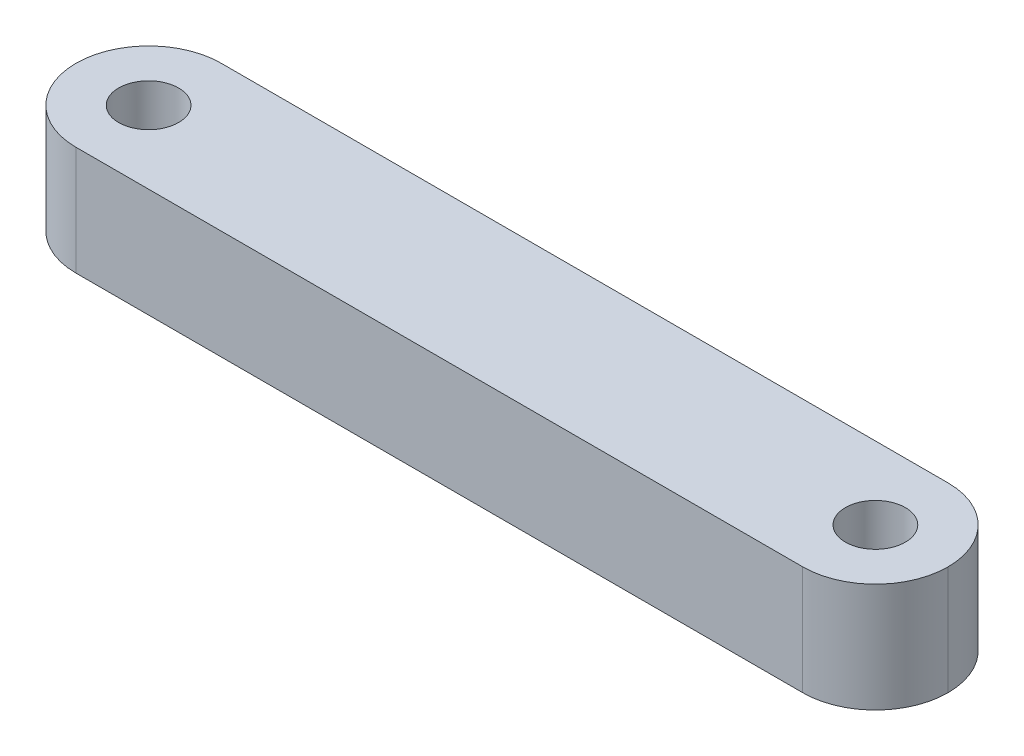
ISO-10303-21;
HEADER;
FILE_DESCRIPTION(('STEP AP214'),'2;1');
FILE_NAME('part.step','',(''),(''),'','','');
FILE_SCHEMA(('AUTOMOTIVE_DESIGN { 1 0 10303 214 1 1 1 1 }'));
ENDSEC;
DATA;
#1=APPLICATION_CONTEXT('core data for automotive mechanical design processes');
#2=APPLICATION_PROTOCOL_DEFINITION('international standard','automotive_design',2000,#1);
#3=PRODUCT_CONTEXT('',#1,'mechanical');
#4=PRODUCT('Part','Part','',(#3));
#5=PRODUCT_RELATED_PRODUCT_CATEGORY('part','',(#4));
#6=PRODUCT_DEFINITION_FORMATION('','',#4);
#7=PRODUCT_DEFINITION_CONTEXT('part definition',#1,'design');
#8=PRODUCT_DEFINITION('design','',#6,#7);
#9=PRODUCT_DEFINITION_SHAPE('','',#8);
#10=(LENGTH_UNIT() NAMED_UNIT(*) SI_UNIT(.MILLI.,.METRE.));
#11=(NAMED_UNIT(*) PLANE_ANGLE_UNIT() SI_UNIT($,.RADIAN.));
#12=(NAMED_UNIT(*) SI_UNIT($,.STERADIAN.) SOLID_ANGLE_UNIT());
#13=UNCERTAINTY_MEASURE_WITH_UNIT(LENGTH_MEASURE(1.E-05),#10,'distance_accuracy_value','');
#14=(GEOMETRIC_REPRESENTATION_CONTEXT(3) GLOBAL_UNCERTAINTY_ASSIGNED_CONTEXT((#13)) GLOBAL_UNIT_ASSIGNED_CONTEXT((#10,
#11,#12)) REPRESENTATION_CONTEXT('',''));
#15=CARTESIAN_POINT('',(0.,0.,0.));
#16=DIRECTION('',(0.,0.,1.));
#17=DIRECTION('',(1.,0.,0.));
#18=AXIS2_PLACEMENT_3D('',#15,#16,#17);
#19=CARTESIAN_POINT('',(-24.,6.,-4.));
#20=DIRECTION('',(0.,0.,1.));
#21=DIRECTION('',(1.,0.,0.));
#22=AXIS2_PLACEMENT_3D('',#19,#20,#21);
#23=PLANE('',#22);
#24=DIRECTION('',(-1.,0.,0.));
#25=VECTOR('',#24,1.);
#26=CARTESIAN_POINT('',(-24.,0.,-4.));
#27=LINE('',#26,#25);
#28=CARTESIAN_POINT('',(20.,0.,-4.));
#29=VERTEX_POINT('',#28);
#30=CARTESIAN_POINT('',(-20.,0.,-4.));
#31=VERTEX_POINT('',#30);
#32=EDGE_CURVE('E117',#29,#31,#27,.T.);
#33=ORIENTED_EDGE('',*,*,#32,.T.);
#34=DIRECTION('',(0.,-1.,0.));
#35=VECTOR('',#34,1.);
#36=CARTESIAN_POINT('',(-20.,6.,-4.));
#37=LINE('',#36,#35);
#38=CARTESIAN_POINT('',(-20.,6.,-4.));
#39=VERTEX_POINT('',#38);
#40=EDGE_CURVE('E11',#31,#39,#37,.F.);
#41=ORIENTED_EDGE('',*,*,#40,.T.);
#42=DIRECTION('',(-1.,0.,0.));
#43=VECTOR('',#42,1.);
#44=CARTESIAN_POINT('',(-24.,6.,-4.));
#45=LINE('',#44,#43);
#46=CARTESIAN_POINT('',(20.,6.,-4.));
#47=VERTEX_POINT('',#46);
#48=EDGE_CURVE('E116',#47,#39,#45,.T.);
#49=ORIENTED_EDGE('',*,*,#48,.F.);
#50=DIRECTION('',(0.,-1.,0.));
#51=VECTOR('',#50,1.);
#52=CARTESIAN_POINT('',(20.,6.,-4.));
#53=LINE('',#52,#51);
#54=EDGE_CURVE('E45',#47,#29,#53,.T.);
#55=ORIENTED_EDGE('',*,*,#54,.T.);
#56=EDGE_LOOP('',(#33,#41,#49,#55));
#57=FACE_BOUND('',#56,.T.);
#58=ADVANCED_FACE('F36',(#57),#23,.F.);
#59=CARTESIAN_POINT('',(-24.,6.,4.));
#60=DIRECTION('',(0.,0.,-1.));
#61=DIRECTION('',(-1.,0.,0.));
#62=AXIS2_PLACEMENT_3D('',#59,#60,#61);
#63=PLANE('',#62);
#64=DIRECTION('',(1.,0.,0.));
#65=VECTOR('',#64,1.);
#66=CARTESIAN_POINT('',(-24.,6.,4.));
#67=LINE('',#66,#65);
#68=CARTESIAN_POINT('',(-20.,6.,4.));
#69=VERTEX_POINT('',#68);
#70=CARTESIAN_POINT('',(20.,6.,4.));
#71=VERTEX_POINT('',#70);
#72=EDGE_CURVE('E110',#69,#71,#67,.T.);
#73=ORIENTED_EDGE('',*,*,#72,.F.);
#74=DIRECTION('',(0.,-1.,0.));
#75=VECTOR('',#74,1.);
#76=CARTESIAN_POINT('',(-20.,6.,4.));
#77=LINE('',#76,#75);
#78=CARTESIAN_POINT('',(-20.,0.,4.));
#79=VERTEX_POINT('',#78);
#80=EDGE_CURVE('E95',#69,#79,#77,.T.);
#81=ORIENTED_EDGE('',*,*,#80,.T.);
#82=DIRECTION('',(1.,0.,0.));
#83=VECTOR('',#82,1.);
#84=CARTESIAN_POINT('',(-24.,0.,4.));
#85=LINE('',#84,#83);
#86=CARTESIAN_POINT('',(20.,0.,4.));
#87=VERTEX_POINT('',#86);
#88=EDGE_CURVE('E107',#79,#87,#85,.T.);
#89=ORIENTED_EDGE('',*,*,#88,.T.);
#90=DIRECTION('',(0.,-1.,0.));
#91=VECTOR('',#90,1.);
#92=CARTESIAN_POINT('',(20.,6.,4.));
#93=LINE('',#92,#91);
#94=EDGE_CURVE('E112',#87,#71,#93,.F.);
#95=ORIENTED_EDGE('',*,*,#94,.T.);
#96=EDGE_LOOP('',(#73,#81,#89,#95));
#97=FACE_BOUND('',#96,.T.);
#98=ADVANCED_FACE('F106',(#97),#63,.F.);
#99=CARTESIAN_POINT('',(0.,6.,0.));
#100=DIRECTION('',(0.,1.,0.));
#101=DIRECTION('',(0.,0.,1.));
#102=AXIS2_PLACEMENT_3D('',#99,#100,#101);
#103=PLANE('',#102);
#104=CARTESIAN_POINT('',(20.,6.,0.));
#105=DIRECTION('',(0.,1.,0.));
#106=DIRECTION('',(0.,0.,1.));
#107=AXIS2_PLACEMENT_3D('',#104,#105,#106);
#108=CIRCLE('',#107,1.65);
#109=CARTESIAN_POINT('',(20.,6.,1.65));
#110=VERTEX_POINT('',#109);
#111=EDGE_CURVE('E127',#110,#110,#108,.T.);
#112=ORIENTED_EDGE('',*,*,#111,.F.);
#113=EDGE_LOOP('',(#112));
#114=FACE_BOUND('',#113,.T.);
#115=CARTESIAN_POINT('',(-20.,6.,0.));
#116=DIRECTION('',(0.,1.,0.));
#117=DIRECTION('',(0.,0.,-1.));
#118=AXIS2_PLACEMENT_3D('',#115,#116,#117);
#119=CIRCLE('',#118,1.65);
#120=CARTESIAN_POINT('',(-20.,6.,-1.65));
#121=VERTEX_POINT('',#120);
#122=EDGE_CURVE('E142',#121,#121,#119,.T.);
#123=ORIENTED_EDGE('',*,*,#122,.F.);
#124=EDGE_LOOP('',(#123));
#125=FACE_BOUND('',#124,.T.);
#126=CARTESIAN_POINT('',(-20.,6.,0.));
#127=DIRECTION('',(0.,1.,0.));
#128=DIRECTION('',(0.,0.,1.));
#129=AXIS2_PLACEMENT_3D('',#126,#127,#128);
#130=CIRCLE('',#129,4.);
#131=CARTESIAN_POINT('',(-24.,6.,0.));
#132=VERTEX_POINT('',#131);
#133=EDGE_CURVE('E53',#39,#132,#130,.T.);
#134=ORIENTED_EDGE('',*,*,#133,.T.);
#135=CARTESIAN_POINT('',(-20.,6.,0.));
#136=DIRECTION('',(0.,1.,0.));
#137=DIRECTION('',(0.,0.,1.));
#138=AXIS2_PLACEMENT_3D('',#135,#136,#137);
#139=CIRCLE('',#138,4.);
#140=EDGE_CURVE('E139',#132,#69,#139,.T.);
#141=ORIENTED_EDGE('',*,*,#140,.T.);
#142=ORIENTED_EDGE('',*,*,#72,.T.);
#143=CARTESIAN_POINT('',(20.,6.,0.));
#144=DIRECTION('',(0.,1.,0.));
#145=DIRECTION('',(0.,0.,1.));
#146=AXIS2_PLACEMENT_3D('',#143,#144,#145);
#147=CIRCLE('',#146,4.);
#148=CARTESIAN_POINT('',(24.,6.,0.));
#149=VERTEX_POINT('',#148);
#150=EDGE_CURVE('E100',#71,#149,#147,.T.);
#151=ORIENTED_EDGE('',*,*,#150,.T.);
#152=CARTESIAN_POINT('',(20.,6.,0.));
#153=DIRECTION('',(0.,1.,0.));
#154=DIRECTION('',(0.,0.,1.));
#155=AXIS2_PLACEMENT_3D('',#152,#153,#154);
#156=CIRCLE('',#155,4.);
#157=EDGE_CURVE('E136',#149,#47,#156,.T.);
#158=ORIENTED_EDGE('',*,*,#157,.T.);
#159=ORIENTED_EDGE('',*,*,#48,.T.);
#160=EDGE_LOOP('',(#134,#141,#142,#151,#158,#159));
#161=FACE_BOUND('',#160,.T.);
#162=ADVANCED_FACE('F153',(#114,#125,#161),#103,.T.);
#163=CARTESIAN_POINT('',(0.,0.,0.));
#164=DIRECTION('',(0.,1.,0.));
#165=DIRECTION('',(0.,0.,1.));
#166=AXIS2_PLACEMENT_3D('',#163,#164,#165);
#167=PLANE('',#166);
#168=CARTESIAN_POINT('',(20.,0.,0.));
#169=DIRECTION('',(0.,1.,0.));
#170=DIRECTION('',(0.,0.,1.));
#171=AXIS2_PLACEMENT_3D('',#168,#169,#170);
#172=CIRCLE('',#171,1.65);
#173=CARTESIAN_POINT('',(20.,0.,1.65));
#174=VERTEX_POINT('',#173);
#175=EDGE_CURVE('E120',#174,#174,#172,.T.);
#176=ORIENTED_EDGE('',*,*,#175,.T.);
#177=EDGE_LOOP('',(#176));
#178=FACE_BOUND('',#177,.T.);
#179=CARTESIAN_POINT('',(-20.,0.,0.));
#180=DIRECTION('',(0.,1.,0.));
#181=DIRECTION('',(0.,0.,1.));
#182=AXIS2_PLACEMENT_3D('',#179,#180,#181);
#183=CIRCLE('',#182,1.65);
#184=CARTESIAN_POINT('',(-20.,0.,1.65));
#185=VERTEX_POINT('',#184);
#186=EDGE_CURVE('E124',#185,#185,#183,.T.);
#187=ORIENTED_EDGE('',*,*,#186,.T.);
#188=EDGE_LOOP('',(#187));
#189=FACE_BOUND('',#188,.T.);
#190=ORIENTED_EDGE('',*,*,#88,.F.);
#191=CARTESIAN_POINT('',(-20.,0.,0.));
#192=DIRECTION('',(0.,1.,0.));
#193=DIRECTION('',(0.,0.,1.));
#194=AXIS2_PLACEMENT_3D('',#191,#192,#193);
#195=CIRCLE('',#194,4.);
#196=CARTESIAN_POINT('',(-24.,0.,0.));
#197=VERTEX_POINT('',#196);
#198=EDGE_CURVE('E91',#79,#197,#195,.F.);
#199=ORIENTED_EDGE('',*,*,#198,.T.);
#200=CARTESIAN_POINT('',(-20.,0.,0.));
#201=DIRECTION('',(0.,1.,0.));
#202=DIRECTION('',(0.,0.,1.));
#203=AXIS2_PLACEMENT_3D('',#200,#201,#202);
#204=CIRCLE('',#203,4.);
#205=EDGE_CURVE('E101',#197,#31,#204,.F.);
#206=ORIENTED_EDGE('',*,*,#205,.T.);
#207=ORIENTED_EDGE('',*,*,#32,.F.);
#208=CARTESIAN_POINT('',(20.,0.,0.));
#209=DIRECTION('',(0.,1.,0.));
#210=DIRECTION('',(0.,0.,1.));
#211=AXIS2_PLACEMENT_3D('',#208,#209,#210);
#212=CIRCLE('',#211,4.);
#213=CARTESIAN_POINT('',(24.,0.,0.));
#214=VERTEX_POINT('',#213);
#215=EDGE_CURVE('E132',#29,#214,#212,.F.);
#216=ORIENTED_EDGE('',*,*,#215,.T.);
#217=CARTESIAN_POINT('',(20.,0.,0.));
#218=DIRECTION('',(0.,1.,0.));
#219=DIRECTION('',(0.,0.,1.));
#220=AXIS2_PLACEMENT_3D('',#217,#218,#219);
#221=CIRCLE('',#220,4.);
#222=EDGE_CURVE('E111',#214,#87,#221,.F.);
#223=ORIENTED_EDGE('',*,*,#222,.T.);
#224=EDGE_LOOP('',(#190,#199,#206,#207,#216,#223));
#225=FACE_BOUND('',#224,.T.);
#226=ADVANCED_FACE('F114',(#178,#189,#225),#167,.F.);
#227=CARTESIAN_POINT('',(-20.,-9.,0.));
#228=DIRECTION('',(0.,1.,0.));
#229=DIRECTION('',(0.,0.,1.));
#230=AXIS2_PLACEMENT_3D('',#227,#228,#229);
#231=CYLINDRICAL_SURFACE('',#230,1.65);
#232=ORIENTED_EDGE('',*,*,#122,.T.);
#233=EDGE_LOOP('',(#232));
#234=FACE_BOUND('',#233,.T.);
#235=ORIENTED_EDGE('',*,*,#186,.F.);
#236=EDGE_LOOP('',(#235));
#237=FACE_BOUND('',#236,.T.);
#238=ADVANCED_FACE('F166',(#234,#237),#231,.F.);
#239=CARTESIAN_POINT('',(20.,-9.,0.));
#240=DIRECTION('',(0.,1.,0.));
#241=DIRECTION('',(0.,0.,1.));
#242=AXIS2_PLACEMENT_3D('',#239,#240,#241);
#243=CYLINDRICAL_SURFACE('',#242,1.65);
#244=ORIENTED_EDGE('',*,*,#111,.T.);
#245=EDGE_LOOP('',(#244));
#246=FACE_BOUND('',#245,.T.);
#247=ORIENTED_EDGE('',*,*,#175,.F.);
#248=EDGE_LOOP('',(#247));
#249=FACE_BOUND('',#248,.T.);
#250=ADVANCED_FACE('F158',(#246,#249),#243,.F.);
#251=CARTESIAN_POINT('',(-20.,6.,0.));
#252=DIRECTION('',(0.,-1.,0.));
#253=DIRECTION('',(0.,0.,-1.));
#254=AXIS2_PLACEMENT_3D('',#251,#252,#253);
#255=CYLINDRICAL_SURFACE('',#254,4.);
#256=DIRECTION('',(0.,-1.,0.));
#257=VECTOR('',#256,1.);
#258=CARTESIAN_POINT('',(-24.,6.,0.));
#259=LINE('',#258,#257);
#260=EDGE_CURVE('E96',#132,#197,#259,.T.);
#261=ORIENTED_EDGE('',*,*,#260,.F.);
#262=ORIENTED_EDGE('',*,*,#133,.F.);
#263=ORIENTED_EDGE('',*,*,#40,.F.);
#264=ORIENTED_EDGE('',*,*,#205,.F.);
#265=EDGE_LOOP('',(#261,#262,#263,#264));
#266=FACE_BOUND('',#265,.T.);
#267=ADVANCED_FACE('F186',(#266),#255,.T.);
#268=CARTESIAN_POINT('',(-20.,6.,0.));
#269=DIRECTION('',(0.,-1.,0.));
#270=DIRECTION('',(0.,0.,-1.));
#271=AXIS2_PLACEMENT_3D('',#268,#269,#270);
#272=CYLINDRICAL_SURFACE('',#271,4.);
#273=ORIENTED_EDGE('',*,*,#140,.F.);
#274=ORIENTED_EDGE('',*,*,#260,.T.);
#275=ORIENTED_EDGE('',*,*,#198,.F.);
#276=ORIENTED_EDGE('',*,*,#80,.F.);
#277=EDGE_LOOP('',(#273,#274,#275,#276));
#278=FACE_BOUND('',#277,.T.);
#279=ADVANCED_FACE('F94',(#278),#272,.T.);
#280=CARTESIAN_POINT('',(20.,6.,0.));
#281=DIRECTION('',(0.,-1.,0.));
#282=DIRECTION('',(0.,0.,-1.));
#283=AXIS2_PLACEMENT_3D('',#280,#281,#282);
#284=CYLINDRICAL_SURFACE('',#283,4.);
#285=DIRECTION('',(0.,-1.,0.));
#286=VECTOR('',#285,1.);
#287=CARTESIAN_POINT('',(24.,6.,0.));
#288=LINE('',#287,#286);
#289=EDGE_CURVE('E40',#149,#214,#288,.T.);
#290=ORIENTED_EDGE('',*,*,#289,.F.);
#291=ORIENTED_EDGE('',*,*,#150,.F.);
#292=ORIENTED_EDGE('',*,*,#94,.F.);
#293=ORIENTED_EDGE('',*,*,#222,.F.);
#294=EDGE_LOOP('',(#290,#291,#292,#293));
#295=FACE_BOUND('',#294,.T.);
#296=ADVANCED_FACE('F38',(#295),#284,.T.);
#297=CARTESIAN_POINT('',(20.,6.,0.));
#298=DIRECTION('',(0.,-1.,0.));
#299=DIRECTION('',(0.,0.,-1.));
#300=AXIS2_PLACEMENT_3D('',#297,#298,#299);
#301=CYLINDRICAL_SURFACE('',#300,4.);
#302=ORIENTED_EDGE('',*,*,#157,.F.);
#303=ORIENTED_EDGE('',*,*,#289,.T.);
#304=ORIENTED_EDGE('',*,*,#215,.F.);
#305=ORIENTED_EDGE('',*,*,#54,.F.);
#306=EDGE_LOOP('',(#302,#303,#304,#305));
#307=FACE_BOUND('',#306,.T.);
#308=ADVANCED_FACE('F149',(#307),#301,.T.);
#309=CLOSED_SHELL('',(#58,#98,#162,#226,#238,#250,#267,#279,#296,#308));
#310=MANIFOLD_SOLID_BREP('B2',#309);
#311=ADVANCED_BREP_SHAPE_REPRESENTATION('',(#18,#310),#14);
#312=SHAPE_DEFINITION_REPRESENTATION(#9,#311);
ENDSEC;
END-ISO-10303-21;
